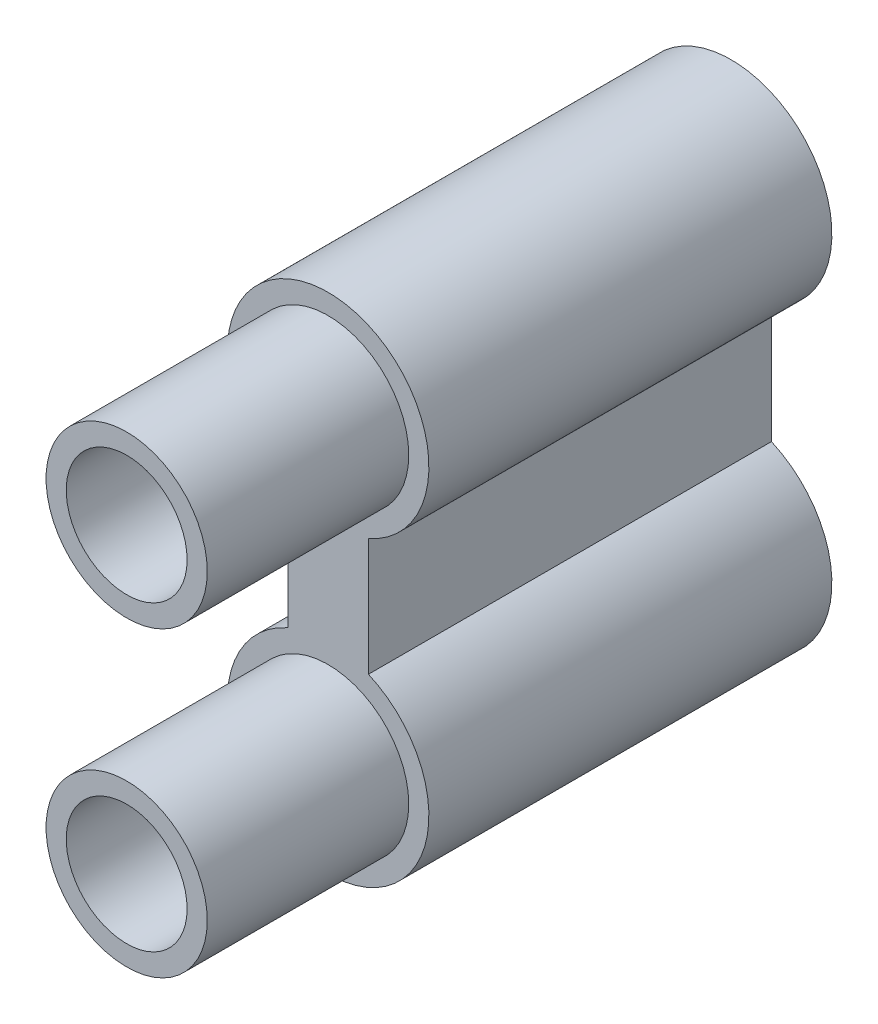
ISO-10303-21;
HEADER;
FILE_DESCRIPTION(('STEP AP214'),'2;1');
FILE_NAME('part.step','',(''),(''),'','','');
FILE_SCHEMA(('AUTOMOTIVE_DESIGN { 1 0 10303 214 1 1 1 1 }'));
ENDSEC;
DATA;
#1=APPLICATION_CONTEXT('core data for automotive mechanical design processes');
#2=APPLICATION_PROTOCOL_DEFINITION('international standard','automotive_design',2000,#1);
#3=PRODUCT_CONTEXT('',#1,'mechanical');
#4=PRODUCT('Part','Part','',(#3));
#5=PRODUCT_RELATED_PRODUCT_CATEGORY('part','',(#4));
#6=PRODUCT_DEFINITION_FORMATION('','',#4);
#7=PRODUCT_DEFINITION_CONTEXT('part definition',#1,'design');
#8=PRODUCT_DEFINITION('design','',#6,#7);
#9=PRODUCT_DEFINITION_SHAPE('','',#8);
#10=(LENGTH_UNIT() NAMED_UNIT(*) SI_UNIT(.MILLI.,.METRE.));
#11=(NAMED_UNIT(*) PLANE_ANGLE_UNIT() SI_UNIT($,.RADIAN.));
#12=(NAMED_UNIT(*) SI_UNIT($,.STERADIAN.) SOLID_ANGLE_UNIT());
#13=UNCERTAINTY_MEASURE_WITH_UNIT(LENGTH_MEASURE(1.E-05),#10,'distance_accuracy_value','');
#14=(GEOMETRIC_REPRESENTATION_CONTEXT(3) GLOBAL_UNCERTAINTY_ASSIGNED_CONTEXT((#13)) GLOBAL_UNIT_ASSIGNED_CONTEXT((#10,
#11,#12)) REPRESENTATION_CONTEXT('',''));
#15=CARTESIAN_POINT('',(0.,0.,0.));
#16=DIRECTION('',(0.,0.,1.));
#17=DIRECTION('',(1.,0.,0.));
#18=AXIS2_PLACEMENT_3D('',#15,#16,#17);
#19=CARTESIAN_POINT('',(0.,75.,150.));
#20=DIRECTION('',(0.,0.,1.));
#21=DIRECTION('',(1.,0.,0.));
#22=AXIS2_PLACEMENT_3D('',#19,#20,#21);
#23=PLANE('',#22);
#24=CARTESIAN_POINT('',(0.,75.,150.));
#25=DIRECTION('',(0.,0.,1.));
#26=DIRECTION('',(1.,0.,0.));
#27=AXIS2_PLACEMENT_3D('',#24,#25,#26);
#28=CIRCLE('',#27,15.);
#29=CARTESIAN_POINT('',(15.,75.,150.));
#30=VERTEX_POINT('',#29);
#31=EDGE_CURVE('E123',#30,#30,#28,.T.);
#32=ORIENTED_EDGE('',*,*,#31,.F.);
#33=EDGE_LOOP('',(#32));
#34=FACE_BOUND('',#33,.T.);
#35=CARTESIAN_POINT('',(0.,75.,150.));
#36=DIRECTION('',(0.,0.,1.));
#37=DIRECTION('',(1.,0.,0.));
#38=AXIS2_PLACEMENT_3D('',#35,#36,#37);
#39=CIRCLE('',#38,20.);
#40=CARTESIAN_POINT('',(20.,75.,150.));
#41=VERTEX_POINT('',#40);
#42=EDGE_CURVE('E119',#41,#41,#39,.T.);
#43=ORIENTED_EDGE('',*,*,#42,.T.);
#44=EDGE_LOOP('',(#43));
#45=FACE_BOUND('',#44,.T.);
#46=ADVANCED_FACE('F34',(#34,#45),#23,.T.);
#47=CARTESIAN_POINT('',(0.,0.,150.));
#48=DIRECTION('',(0.,0.,1.));
#49=DIRECTION('',(1.,0.,0.));
#50=AXIS2_PLACEMENT_3D('',#47,#48,#49);
#51=CIRCLE('',#50,15.);
#52=CARTESIAN_POINT('',(15.,0.,150.));
#53=VERTEX_POINT('',#52);
#54=EDGE_CURVE('E107',#53,#53,#51,.T.);
#55=ORIENTED_EDGE('',*,*,#54,.F.);
#56=EDGE_LOOP('',(#55));
#57=FACE_BOUND('',#56,.T.);
#58=CARTESIAN_POINT('',(0.,0.,150.));
#59=DIRECTION('',(0.,0.,1.));
#60=DIRECTION('',(1.,0.,0.));
#61=AXIS2_PLACEMENT_3D('',#58,#59,#60);
#62=CIRCLE('',#61,20.);
#63=CARTESIAN_POINT('',(20.,0.,150.));
#64=VERTEX_POINT('',#63);
#65=EDGE_CURVE('E243',#64,#64,#62,.T.);
#66=ORIENTED_EDGE('',*,*,#65,.T.);
#67=EDGE_LOOP('',(#66));
#68=FACE_BOUND('',#67,.T.);
#69=ADVANCED_FACE('F145',(#57,#68),#23,.T.);
#70=CARTESIAN_POINT('',(0.,75.,150.));
#71=DIRECTION('',(0.,0.,-1.));
#72=DIRECTION('',(-1.,0.,0.));
#73=AXIS2_PLACEMENT_3D('',#70,#71,#72);
#74=CYLINDRICAL_SURFACE('',#73,25.);
#75=CARTESIAN_POINT('',(0.,75.,100.));
#76=DIRECTION('',(0.,0.,1.));
#77=DIRECTION('',(1.,0.,0.));
#78=AXIS2_PLACEMENT_3D('',#75,#76,#77);
#79=CIRCLE('',#78,25.);
#80=CARTESIAN_POINT('',(10.,52.0871215252208,100.));
#81=VERTEX_POINT('',#80);
#82=CARTESIAN_POINT('',(-10.,52.0871215252208,100.));
#83=VERTEX_POINT('',#82);
#84=EDGE_CURVE('E74',#81,#83,#79,.T.);
#85=ORIENTED_EDGE('',*,*,#84,.F.);
#86=DIRECTION('',(0.,0.,-1.));
#87=VECTOR('',#86,1.);
#88=CARTESIAN_POINT('',(10.,52.0871215252208,150.));
#89=LINE('',#88,#87);
#90=CARTESIAN_POINT('',(10.,52.0871215252208,0.));
#91=VERTEX_POINT('',#90);
#92=EDGE_CURVE('E56',#81,#91,#89,.T.);
#93=ORIENTED_EDGE('',*,*,#92,.T.);
#94=CARTESIAN_POINT('',(0.,75.,0.));
#95=DIRECTION('',(0.,0.,1.));
#96=DIRECTION('',(1.,0.,0.));
#97=AXIS2_PLACEMENT_3D('',#94,#95,#96);
#98=CIRCLE('',#97,25.);
#99=CARTESIAN_POINT('',(-10.,52.0871215252208,0.));
#100=VERTEX_POINT('',#99);
#101=EDGE_CURVE('E104',#91,#100,#98,.T.);
#102=ORIENTED_EDGE('',*,*,#101,.T.);
#103=DIRECTION('',(0.,0.,-1.));
#104=VECTOR('',#103,1.);
#105=CARTESIAN_POINT('',(-10.,52.0871215252208,150.));
#106=LINE('',#105,#104);
#107=EDGE_CURVE('E42',#83,#100,#106,.T.);
#108=ORIENTED_EDGE('',*,*,#107,.F.);
#109=EDGE_LOOP('',(#85,#93,#102,#108));
#110=FACE_BOUND('',#109,.T.);
#111=ADVANCED_FACE('F36',(#110),#74,.T.);
#112=CARTESIAN_POINT('',(-10.,52.0871215252208,150.));
#113=DIRECTION('',(1.,0.,0.));
#114=DIRECTION('',(0.,0.,-1.));
#115=AXIS2_PLACEMENT_3D('',#112,#113,#114);
#116=PLANE('',#115);
#117=DIRECTION('',(0.,-1.,0.));
#118=VECTOR('',#117,1.);
#119=CARTESIAN_POINT('',(-10.,52.0871215252208,100.));
#120=LINE('',#119,#118);
#121=CARTESIAN_POINT('',(-10.,22.9128784747792,100.));
#122=VERTEX_POINT('',#121);
#123=EDGE_CURVE('E80',#83,#122,#120,.T.);
#124=ORIENTED_EDGE('',*,*,#123,.F.);
#125=ORIENTED_EDGE('',*,*,#107,.T.);
#126=DIRECTION('',(0.,-1.,0.));
#127=VECTOR('',#126,1.);
#128=CARTESIAN_POINT('',(-10.,52.0871215252208,0.));
#129=LINE('',#128,#127);
#130=CARTESIAN_POINT('',(-10.,22.9128784747792,0.));
#131=VERTEX_POINT('',#130);
#132=EDGE_CURVE('E99',#100,#131,#129,.T.);
#133=ORIENTED_EDGE('',*,*,#132,.T.);
#134=DIRECTION('',(0.,0.,-1.));
#135=VECTOR('',#134,1.);
#136=CARTESIAN_POINT('',(-10.,22.9128784747792,150.));
#137=LINE('',#136,#135);
#138=EDGE_CURVE('E88',#122,#131,#137,.T.);
#139=ORIENTED_EDGE('',*,*,#138,.F.);
#140=EDGE_LOOP('',(#124,#125,#133,#139));
#141=FACE_BOUND('',#140,.T.);
#142=ADVANCED_FACE('F97',(#141),#116,.F.);
#143=CARTESIAN_POINT('',(0.,0.,150.));
#144=DIRECTION('',(0.,0.,-1.));
#145=DIRECTION('',(-1.,0.,0.));
#146=AXIS2_PLACEMENT_3D('',#143,#144,#145);
#147=CYLINDRICAL_SURFACE('',#146,25.);
#148=CARTESIAN_POINT('',(0.,0.,100.));
#149=DIRECTION('',(0.,0.,1.));
#150=DIRECTION('',(1.,0.,0.));
#151=AXIS2_PLACEMENT_3D('',#148,#149,#150);
#152=CIRCLE('',#151,25.);
#153=CARTESIAN_POINT('',(10.,22.9128784747792,100.));
#154=VERTEX_POINT('',#153);
#155=EDGE_CURVE('E48',#122,#154,#152,.T.);
#156=ORIENTED_EDGE('',*,*,#155,.F.);
#157=ORIENTED_EDGE('',*,*,#138,.T.);
#158=CARTESIAN_POINT('',(0.,0.,0.));
#159=DIRECTION('',(0.,0.,1.));
#160=DIRECTION('',(1.,0.,0.));
#161=AXIS2_PLACEMENT_3D('',#158,#159,#160);
#162=CIRCLE('',#161,25.);
#163=CARTESIAN_POINT('',(10.,22.9128784747792,0.));
#164=VERTEX_POINT('',#163);
#165=EDGE_CURVE('E90',#131,#164,#162,.T.);
#166=ORIENTED_EDGE('',*,*,#165,.T.);
#167=DIRECTION('',(0.,0.,-1.));
#168=VECTOR('',#167,1.);
#169=CARTESIAN_POINT('',(10.,22.9128784747792,150.));
#170=LINE('',#169,#168);
#171=EDGE_CURVE('E86',#154,#164,#170,.T.);
#172=ORIENTED_EDGE('',*,*,#171,.F.);
#173=EDGE_LOOP('',(#156,#157,#166,#172));
#174=FACE_BOUND('',#173,.T.);
#175=ADVANCED_FACE('F114',(#174),#147,.T.);
#176=CARTESIAN_POINT('',(10.,22.9128784747792,150.));
#177=DIRECTION('',(-1.,0.,0.));
#178=DIRECTION('',(0.,0.,1.));
#179=AXIS2_PLACEMENT_3D('',#176,#177,#178);
#180=PLANE('',#179);
#181=DIRECTION('',(0.,1.,0.));
#182=VECTOR('',#181,1.);
#183=CARTESIAN_POINT('',(10.,22.9128784747792,100.));
#184=LINE('',#183,#182);
#185=EDGE_CURVE('E12',#154,#81,#184,.T.);
#186=ORIENTED_EDGE('',*,*,#185,.F.);
#187=ORIENTED_EDGE('',*,*,#171,.T.);
#188=DIRECTION('',(0.,1.,0.));
#189=VECTOR('',#188,1.);
#190=CARTESIAN_POINT('',(10.,22.9128784747792,0.));
#191=LINE('',#190,#189);
#192=EDGE_CURVE('E84',#164,#91,#191,.T.);
#193=ORIENTED_EDGE('',*,*,#192,.T.);
#194=ORIENTED_EDGE('',*,*,#92,.F.);
#195=EDGE_LOOP('',(#186,#187,#193,#194));
#196=FACE_BOUND('',#195,.T.);
#197=ADVANCED_FACE('F82',(#196),#180,.F.);
#198=CARTESIAN_POINT('',(0.,75.,0.));
#199=DIRECTION('',(0.,0.,1.));
#200=DIRECTION('',(1.,0.,0.));
#201=AXIS2_PLACEMENT_3D('',#198,#199,#200);
#202=PLANE('',#201);
#203=ORIENTED_EDGE('',*,*,#101,.F.);
#204=ORIENTED_EDGE('',*,*,#192,.F.);
#205=ORIENTED_EDGE('',*,*,#165,.F.);
#206=ORIENTED_EDGE('',*,*,#132,.F.);
#207=EDGE_LOOP('',(#203,#204,#205,#206));
#208=FACE_BOUND('',#207,.T.);
#209=CARTESIAN_POINT('',(0.,0.,0.));
#210=DIRECTION('',(0.,0.,1.));
#211=DIRECTION('',(1.,0.,0.));
#212=AXIS2_PLACEMENT_3D('',#209,#210,#211);
#213=CIRCLE('',#212,15.);
#214=CARTESIAN_POINT('',(15.,0.,0.));
#215=VERTEX_POINT('',#214);
#216=EDGE_CURVE('E110',#215,#215,#213,.T.);
#217=ORIENTED_EDGE('',*,*,#216,.T.);
#218=EDGE_LOOP('',(#217));
#219=FACE_BOUND('',#218,.T.);
#220=CARTESIAN_POINT('',(0.,75.,0.));
#221=DIRECTION('',(0.,0.,1.));
#222=DIRECTION('',(1.,0.,0.));
#223=AXIS2_PLACEMENT_3D('',#220,#221,#222);
#224=CIRCLE('',#223,15.);
#225=CARTESIAN_POINT('',(15.,75.,0.));
#226=VERTEX_POINT('',#225);
#227=EDGE_CURVE('E79',#226,#226,#224,.T.);
#228=ORIENTED_EDGE('',*,*,#227,.T.);
#229=EDGE_LOOP('',(#228));
#230=FACE_BOUND('',#229,.T.);
#231=ADVANCED_FACE('F102',(#208,#219,#230),#202,.F.);
#232=CARTESIAN_POINT('',(0.,0.,150.));
#233=DIRECTION('',(0.,0.,-1.));
#234=DIRECTION('',(-1.,0.,0.));
#235=AXIS2_PLACEMENT_3D('',#232,#233,#234);
#236=CYLINDRICAL_SURFACE('',#235,15.);
#237=ORIENTED_EDGE('',*,*,#54,.T.);
#238=EDGE_LOOP('',(#237));
#239=FACE_BOUND('',#238,.T.);
#240=ORIENTED_EDGE('',*,*,#216,.F.);
#241=EDGE_LOOP('',(#240));
#242=FACE_BOUND('',#241,.T.);
#243=ADVANCED_FACE('F132',(#239,#242),#236,.F.);
#244=CARTESIAN_POINT('',(0.,75.,150.));
#245=DIRECTION('',(0.,0.,-1.));
#246=DIRECTION('',(-1.,0.,0.));
#247=AXIS2_PLACEMENT_3D('',#244,#245,#246);
#248=CYLINDRICAL_SURFACE('',#247,15.);
#249=ORIENTED_EDGE('',*,*,#31,.T.);
#250=EDGE_LOOP('',(#249));
#251=FACE_BOUND('',#250,.T.);
#252=ORIENTED_EDGE('',*,*,#227,.F.);
#253=EDGE_LOOP('',(#252));
#254=FACE_BOUND('',#253,.T.);
#255=ADVANCED_FACE('F130',(#251,#254),#248,.F.);
#256=CARTESIAN_POINT('',(0.,37.5,100.));
#257=DIRECTION('',(0.,0.,1.));
#258=DIRECTION('',(1.,0.,0.));
#259=AXIS2_PLACEMENT_3D('',#256,#257,#258);
#260=PLANE('',#259);
#261=CARTESIAN_POINT('',(0.,75.,100.));
#262=DIRECTION('',(0.,0.,1.));
#263=DIRECTION('',(1.,0.,0.));
#264=AXIS2_PLACEMENT_3D('',#261,#262,#263);
#265=CIRCLE('',#264,20.);
#266=CARTESIAN_POINT('',(20.,75.,100.));
#267=VERTEX_POINT('',#266);
#268=EDGE_CURVE('E115',#267,#267,#265,.T.);
#269=ORIENTED_EDGE('',*,*,#268,.F.);
#270=EDGE_LOOP('',(#269));
#271=FACE_BOUND('',#270,.T.);
#272=CARTESIAN_POINT('',(0.,0.,100.));
#273=DIRECTION('',(0.,0.,1.));
#274=DIRECTION('',(1.,0.,0.));
#275=AXIS2_PLACEMENT_3D('',#272,#273,#274);
#276=CIRCLE('',#275,20.);
#277=CARTESIAN_POINT('',(20.,0.,100.));
#278=VERTEX_POINT('',#277);
#279=EDGE_CURVE('E240',#278,#278,#276,.T.);
#280=ORIENTED_EDGE('',*,*,#279,.F.);
#281=EDGE_LOOP('',(#280));
#282=FACE_BOUND('',#281,.T.);
#283=ORIENTED_EDGE('',*,*,#84,.T.);
#284=ORIENTED_EDGE('',*,*,#123,.T.);
#285=ORIENTED_EDGE('',*,*,#155,.T.);
#286=ORIENTED_EDGE('',*,*,#185,.T.);
#287=EDGE_LOOP('',(#283,#284,#285,#286));
#288=FACE_BOUND('',#287,.T.);
#289=ADVANCED_FACE('F73',(#271,#282,#288),#260,.T.);
#290=CARTESIAN_POINT('',(0.,75.,100.));
#291=DIRECTION('',(0.,0.,1.));
#292=DIRECTION('',(1.,0.,0.));
#293=AXIS2_PLACEMENT_3D('',#290,#291,#292);
#294=CYLINDRICAL_SURFACE('',#293,20.);
#295=ORIENTED_EDGE('',*,*,#268,.T.);
#296=EDGE_LOOP('',(#295));
#297=FACE_BOUND('',#296,.T.);
#298=ORIENTED_EDGE('',*,*,#42,.F.);
#299=EDGE_LOOP('',(#298));
#300=FACE_BOUND('',#299,.T.);
#301=ADVANCED_FACE('F139',(#297,#300),#294,.T.);
#302=CARTESIAN_POINT('',(0.,0.,100.));
#303=DIRECTION('',(0.,0.,1.));
#304=DIRECTION('',(1.,0.,0.));
#305=AXIS2_PLACEMENT_3D('',#302,#303,#304);
#306=CYLINDRICAL_SURFACE('',#305,20.);
#307=ORIENTED_EDGE('',*,*,#279,.T.);
#308=EDGE_LOOP('',(#307));
#309=FACE_BOUND('',#308,.T.);
#310=ORIENTED_EDGE('',*,*,#65,.F.);
#311=EDGE_LOOP('',(#310));
#312=FACE_BOUND('',#311,.T.);
#313=ADVANCED_FACE('F223',(#309,#312),#306,.T.);
#314=CLOSED_SHELL('',(#46,#69,#111,#142,#175,#197,#231,#243,#255,#289,#301,#313));
#315=MANIFOLD_SOLID_BREP('B2',#314);
#316=ADVANCED_BREP_SHAPE_REPRESENTATION('',(#18,#315),#14);
#317=SHAPE_DEFINITION_REPRESENTATION(#9,#316);
ENDSEC;
END-ISO-10303-21;
